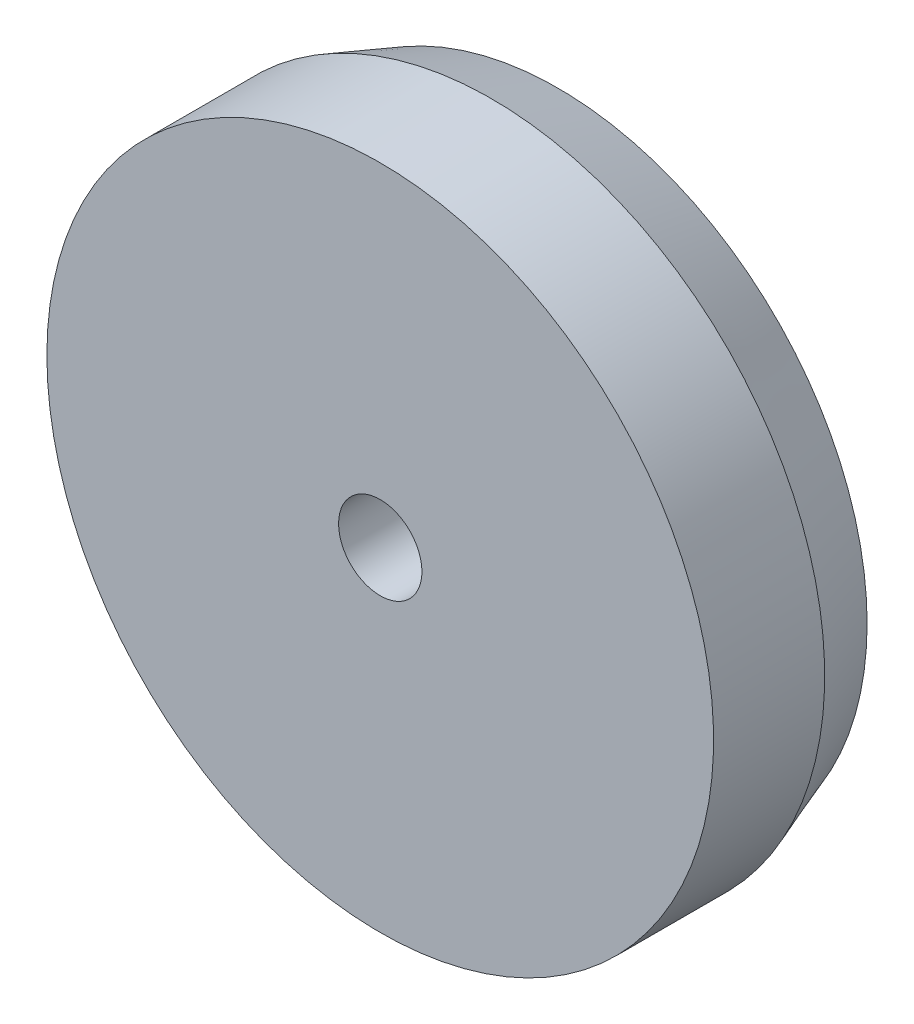
ISO-10303-21;
HEADER;
FILE_DESCRIPTION(('STEP AP214'),'2;1');
FILE_NAME('part.step','',(''),(''),'','','');
FILE_SCHEMA(('AUTOMOTIVE_DESIGN { 1 0 10303 214 1 1 1 1 }'));
ENDSEC;
DATA;
#1=APPLICATION_CONTEXT('core data for automotive mechanical design processes');
#2=APPLICATION_PROTOCOL_DEFINITION('international standard','automotive_design',2000,#1);
#3=PRODUCT_CONTEXT('',#1,'mechanical');
#4=PRODUCT('Part','Part','',(#3));
#5=PRODUCT_RELATED_PRODUCT_CATEGORY('part','',(#4));
#6=PRODUCT_DEFINITION_FORMATION('','',#4);
#7=PRODUCT_DEFINITION_CONTEXT('part definition',#1,'design');
#8=PRODUCT_DEFINITION('design','',#6,#7);
#9=PRODUCT_DEFINITION_SHAPE('','',#8);
#10=(LENGTH_UNIT() NAMED_UNIT(*) SI_UNIT(.MILLI.,.METRE.));
#11=(NAMED_UNIT(*) PLANE_ANGLE_UNIT() SI_UNIT($,.RADIAN.));
#12=(NAMED_UNIT(*) SI_UNIT($,.STERADIAN.) SOLID_ANGLE_UNIT());
#13=UNCERTAINTY_MEASURE_WITH_UNIT(LENGTH_MEASURE(1.E-05),#10,'distance_accuracy_value','');
#14=(GEOMETRIC_REPRESENTATION_CONTEXT(3) GLOBAL_UNCERTAINTY_ASSIGNED_CONTEXT((#13)) GLOBAL_UNIT_ASSIGNED_CONTEXT((#10,
#11,#12)) REPRESENTATION_CONTEXT('',''));
#15=CARTESIAN_POINT('',(0.,0.,0.));
#16=DIRECTION('',(0.,0.,1.));
#17=DIRECTION('',(1.,0.,0.));
#18=AXIS2_PLACEMENT_3D('',#15,#16,#17);
#19=CARTESIAN_POINT('',(4.69701770194955,-10.6460002522325,-1.99));
#20=DIRECTION('',(0.,0.,1.));
#21=DIRECTION('',(1.,0.,0.));
#22=AXIS2_PLACEMENT_3D('',#19,#20,#21);
#23=CONICAL_SURFACE('',#22,0.556323571888055,0.349065850398869);
#24=CARTESIAN_POINT('',(4.69701770194955,-10.6460002522325,-1.87));
#25=DIRECTION('',(0.,0.,-1.));
#26=DIRECTION('',(-1.,0.,0.));
#27=AXIS2_PLACEMENT_3D('',#24,#25,#26);
#28=CIRCLE('',#27,0.6);
#29=CARTESIAN_POINT('',(4.09701770194955,-10.6460002522325,-1.87));
#30=VERTEX_POINT('',#29);
#31=EDGE_CURVE('E52',#30,#30,#28,.T.);
#32=ORIENTED_EDGE('',*,*,#31,.T.);
#33=EDGE_LOOP('',(#32));
#34=FACE_BOUND('',#33,.T.);
#35=CARTESIAN_POINT('',(4.69701770194955,-10.6460002522325,-1.99));
#36=DIRECTION('',(0.,0.,-1.));
#37=DIRECTION('',(-1.,0.,0.));
#38=AXIS2_PLACEMENT_3D('',#35,#36,#37);
#39=CIRCLE('',#38,0.556323571888055);
#40=CARTESIAN_POINT('',(4.14069413006149,-10.6460002522325,-1.99));
#41=VERTEX_POINT('',#40);
#42=EDGE_CURVE('E10',#41,#41,#39,.T.);
#43=ORIENTED_EDGE('',*,*,#42,.F.);
#44=EDGE_LOOP('',(#43));
#45=FACE_BOUND('',#44,.T.);
#46=ADVANCED_FACE('F30',(#34,#45),#23,.T.);
#47=CARTESIAN_POINT('',(5.14701770194955,-10.6460002522325,-1.99));
#48=DIRECTION('',(0.,0.,-1.));
#49=DIRECTION('',(-1.,0.,0.));
#50=AXIS2_PLACEMENT_3D('',#47,#48,#49);
#51=PLANE('',#50);
#52=ORIENTED_EDGE('',*,*,#42,.T.);
#53=EDGE_LOOP('',(#52));
#54=FACE_BOUND('',#53,.T.);
#55=CARTESIAN_POINT('',(4.69701770194955,-10.6460002522325,-1.99));
#56=DIRECTION('',(0.,0.,-1.));
#57=DIRECTION('',(-1.,0.,0.));
#58=AXIS2_PLACEMENT_3D('',#55,#56,#57);
#59=CIRCLE('',#58,0.45);
#60=CARTESIAN_POINT('',(4.24701770194955,-10.6460002522325,-1.99));
#61=VERTEX_POINT('',#60);
#62=EDGE_CURVE('E36',#61,#61,#59,.T.);
#63=ORIENTED_EDGE('',*,*,#62,.F.);
#64=EDGE_LOOP('',(#63));
#65=FACE_BOUND('',#64,.T.);
#66=ADVANCED_FACE('F70',(#54,#65),#51,.T.);
#67=CARTESIAN_POINT('',(4.69701770194955,-10.6460002522325,-2.7503125));
#68=DIRECTION('',(0.,0.,-1.));
#69=DIRECTION('',(1.,0.,0.));
#70=AXIS2_PLACEMENT_3D('',#67,#68,#69);
#71=SPHERICAL_SURFACE('',#70,0.883501611575357);
#72=ORIENTED_EDGE('',*,*,#62,.T.);
#73=EDGE_LOOP('',(#72));
#74=FACE_BOUND('',#73,.T.);
#75=CARTESIAN_POINT('',(4.69701770194955,-10.6460002522325,-1.87));
#76=DIRECTION('',(0.,0.,-1.));
#77=DIRECTION('',(-1.,0.,0.));
#78=AXIS2_PLACEMENT_3D('',#75,#76,#77);
#79=CIRCLE('',#78,0.0750000000000004);
#80=CARTESIAN_POINT('',(4.62201770194955,-10.6460002522325,-1.87));
#81=VERTEX_POINT('',#80);
#82=EDGE_CURVE('E40',#81,#81,#79,.T.);
#83=ORIENTED_EDGE('',*,*,#82,.F.);
#84=EDGE_LOOP('',(#83));
#85=FACE_BOUND('',#84,.T.);
#86=ADVANCED_FACE('F74',(#74,#85),#71,.F.);
#87=CARTESIAN_POINT('',(4.69701770194955,-10.6460002522325,-1.67));
#88=DIRECTION('',(0.,0.,-1.));
#89=DIRECTION('',(-1.,0.,0.));
#90=AXIS2_PLACEMENT_3D('',#87,#88,#89);
#91=CYLINDRICAL_SURFACE('',#90,0.0750000000000004);
#92=ORIENTED_EDGE('',*,*,#82,.T.);
#93=EDGE_LOOP('',(#92));
#94=FACE_BOUND('',#93,.T.);
#95=CARTESIAN_POINT('',(4.69701770194955,-10.6460002522325,-1.67));
#96=DIRECTION('',(0.,0.,-1.));
#97=DIRECTION('',(-1.,0.,0.));
#98=AXIS2_PLACEMENT_3D('',#95,#96,#97);
#99=CIRCLE('',#98,0.0750000000000004);
#100=CARTESIAN_POINT('',(4.62201770194955,-10.6460002522325,-1.67));
#101=VERTEX_POINT('',#100);
#102=EDGE_CURVE('E44',#101,#101,#99,.T.);
#103=ORIENTED_EDGE('',*,*,#102,.F.);
#104=EDGE_LOOP('',(#103));
#105=FACE_BOUND('',#104,.T.);
#106=ADVANCED_FACE('F66',(#94,#105),#91,.F.);
#107=CARTESIAN_POINT('',(5.29701770194955,-10.6460002522325,-1.67));
#108=DIRECTION('',(0.,0.,1.));
#109=DIRECTION('',(1.,0.,0.));
#110=AXIS2_PLACEMENT_3D('',#107,#108,#109);
#111=PLANE('',#110);
#112=ORIENTED_EDGE('',*,*,#102,.T.);
#113=EDGE_LOOP('',(#112));
#114=FACE_BOUND('',#113,.T.);
#115=CARTESIAN_POINT('',(4.69701770194955,-10.6460002522325,-1.67));
#116=DIRECTION('',(0.,0.,-1.));
#117=DIRECTION('',(-1.,0.,0.));
#118=AXIS2_PLACEMENT_3D('',#115,#116,#117);
#119=CIRCLE('',#118,0.6);
#120=CARTESIAN_POINT('',(4.09701770194955,-10.6460002522325,-1.67));
#121=VERTEX_POINT('',#120);
#122=EDGE_CURVE('E49',#121,#121,#119,.T.);
#123=ORIENTED_EDGE('',*,*,#122,.F.);
#124=EDGE_LOOP('',(#123));
#125=FACE_BOUND('',#124,.T.);
#126=ADVANCED_FACE('F60',(#114,#125),#111,.T.);
#127=CARTESIAN_POINT('',(4.69701770194955,-10.6460002522325,-1.67));
#128=DIRECTION('',(0.,0.,-1.));
#129=DIRECTION('',(-1.,0.,0.));
#130=AXIS2_PLACEMENT_3D('',#127,#128,#129);
#131=CYLINDRICAL_SURFACE('',#130,0.6);
#132=ORIENTED_EDGE('',*,*,#122,.T.);
#133=EDGE_LOOP('',(#132));
#134=FACE_BOUND('',#133,.T.);
#135=ORIENTED_EDGE('',*,*,#31,.F.);
#136=EDGE_LOOP('',(#135));
#137=FACE_BOUND('',#136,.T.);
#138=ADVANCED_FACE('F58',(#134,#137),#131,.T.);
#139=CLOSED_SHELL('',(#46,#66,#86,#106,#126,#138));
#140=MANIFOLD_SOLID_BREP('B2',#139);
#141=ADVANCED_BREP_SHAPE_REPRESENTATION('',(#18,#140),#14);
#142=SHAPE_DEFINITION_REPRESENTATION(#9,#141);
ENDSEC;
END-ISO-10303-21;
